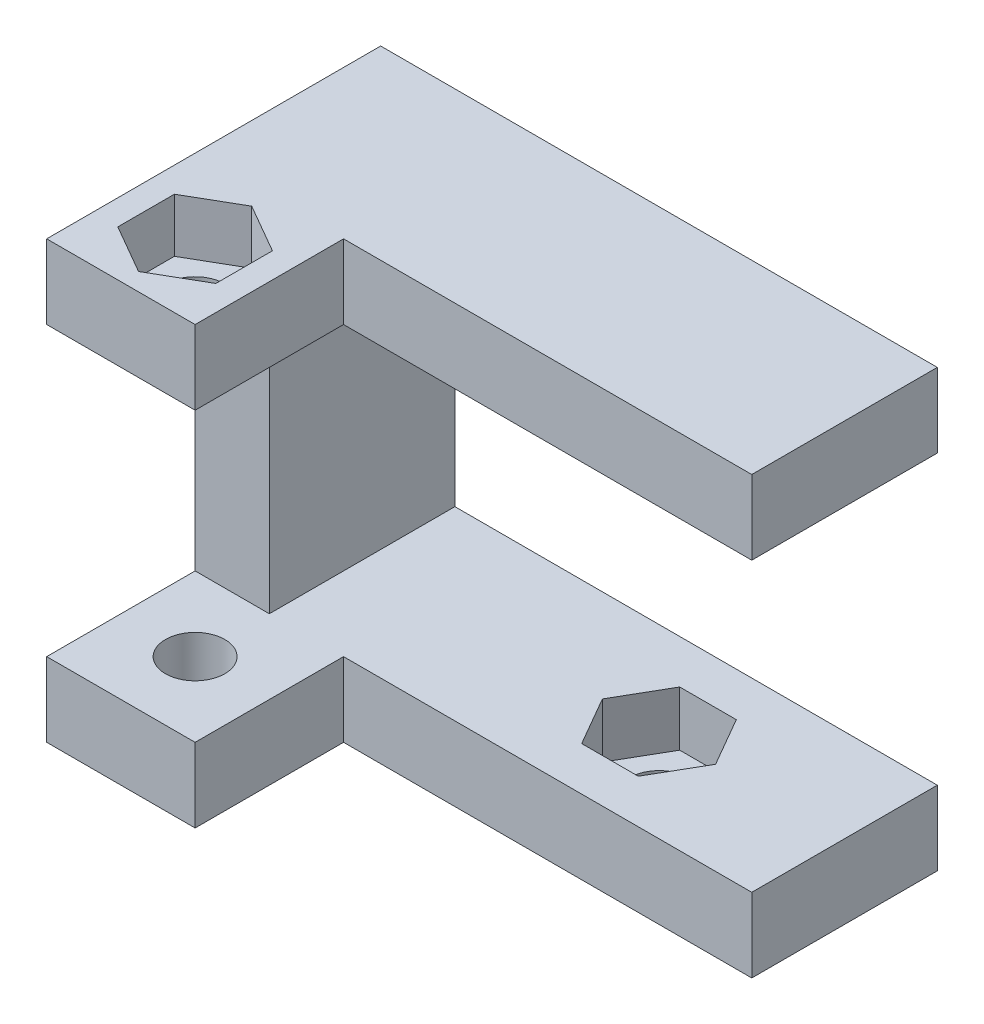
ISO-10303-21;
HEADER;
FILE_DESCRIPTION(('STEP AP214'),'2;1');
FILE_NAME('part.step','',(''),(''),'','','');
FILE_SCHEMA(('AUTOMOTIVE_DESIGN { 1 0 10303 214 1 1 1 1 }'));
ENDSEC;
DATA;
#1=APPLICATION_CONTEXT('core data for automotive mechanical design processes');
#2=APPLICATION_PROTOCOL_DEFINITION('international standard','automotive_design',2000,#1);
#3=PRODUCT_CONTEXT('',#1,'mechanical');
#4=PRODUCT('Part','Part','',(#3));
#5=PRODUCT_RELATED_PRODUCT_CATEGORY('part','',(#4));
#6=PRODUCT_DEFINITION_FORMATION('','',#4);
#7=PRODUCT_DEFINITION_CONTEXT('part definition',#1,'design');
#8=PRODUCT_DEFINITION('design','',#6,#7);
#9=PRODUCT_DEFINITION_SHAPE('','',#8);
#10=(LENGTH_UNIT() NAMED_UNIT(*) SI_UNIT(.MILLI.,.METRE.));
#11=(NAMED_UNIT(*) PLANE_ANGLE_UNIT() SI_UNIT($,.RADIAN.));
#12=(NAMED_UNIT(*) SI_UNIT($,.STERADIAN.) SOLID_ANGLE_UNIT());
#13=UNCERTAINTY_MEASURE_WITH_UNIT(LENGTH_MEASURE(1.E-05),#10,'distance_accuracy_value','');
#14=(GEOMETRIC_REPRESENTATION_CONTEXT(3) GLOBAL_UNCERTAINTY_ASSIGNED_CONTEXT((#13)) GLOBAL_UNIT_ASSIGNED_CONTEXT((#10,
#11,#12)) REPRESENTATION_CONTEXT('',''));
#15=CARTESIAN_POINT('',(0.,0.,0.));
#16=DIRECTION('',(0.,0.,1.));
#17=DIRECTION('',(1.,0.,0.));
#18=AXIS2_PLACEMENT_3D('',#15,#16,#17);
#19=CARTESIAN_POINT('',(0.,0.,10.));
#20=DIRECTION('',(0.,0.,1.));
#21=DIRECTION('',(1.,0.,0.));
#22=AXIS2_PLACEMENT_3D('',#19,#20,#21);
#23=PLANE('',#22);
#24=DIRECTION('',(-1.,0.,0.));
#25=VECTOR('',#24,1.);
#26=CARTESIAN_POINT('',(0.,-19.5,10.));
#27=LINE('',#26,#25);
#28=CARTESIAN_POINT('',(0.,-19.5,10.));
#29=VERTEX_POINT('',#28);
#30=CARTESIAN_POINT('',(-22.,-19.5,10.));
#31=VERTEX_POINT('',#30);
#32=EDGE_CURVE('E57',#29,#31,#27,.T.);
#33=ORIENTED_EDGE('',*,*,#32,.T.);
#34=DIRECTION('',(0.,1.,0.));
#35=VECTOR('',#34,1.);
#36=CARTESIAN_POINT('',(-22.,-23.5,10.));
#37=LINE('',#36,#35);
#38=CARTESIAN_POINT('',(-22.,-23.5,10.));
#39=VERTEX_POINT('',#38);
#40=EDGE_CURVE('E257',#39,#31,#37,.T.);
#41=ORIENTED_EDGE('',*,*,#40,.F.);
#42=DIRECTION('',(1.,0.,0.));
#43=VECTOR('',#42,1.);
#44=CARTESIAN_POINT('',(-30.,-23.5,10.));
#45=LINE('',#44,#43);
#46=CARTESIAN_POINT('',(0.,-23.5,10.));
#47=VERTEX_POINT('',#46);
#48=EDGE_CURVE('E372',#39,#47,#45,.T.);
#49=ORIENTED_EDGE('',*,*,#48,.T.);
#50=DIRECTION('',(0.,1.,0.));
#51=VECTOR('',#50,1.);
#52=CARTESIAN_POINT('',(0.,-23.5,10.));
#53=LINE('',#52,#51);
#54=EDGE_CURVE('E484',#47,#29,#53,.T.);
#55=ORIENTED_EDGE('',*,*,#54,.T.);
#56=EDGE_LOOP('',(#33,#41,#49,#55));
#57=FACE_BOUND('',#56,.T.);
#58=ADVANCED_FACE('F33',(#57),#23,.T.);
#59=DIRECTION('',(0.,-1.,0.));
#60=VECTOR('',#59,1.);
#61=CARTESIAN_POINT('',(-30.,0.,10.));
#62=LINE('',#61,#60);
#63=CARTESIAN_POINT('',(-30.,-4.,10.));
#64=VERTEX_POINT('',#63);
#65=CARTESIAN_POINT('',(-30.,-19.5,10.));
#66=VERTEX_POINT('',#65);
#67=EDGE_CURVE('E369',#64,#66,#62,.T.);
#68=ORIENTED_EDGE('',*,*,#67,.T.);
#69=DIRECTION('',(1.,0.,0.));
#70=VECTOR('',#69,1.);
#71=CARTESIAN_POINT('',(0.,-19.5,10.));
#72=LINE('',#71,#70);
#73=CARTESIAN_POINT('',(-26.,-19.5,10.));
#74=VERTEX_POINT('',#73);
#75=EDGE_CURVE('E11',#66,#74,#72,.T.);
#76=ORIENTED_EDGE('',*,*,#75,.T.);
#77=DIRECTION('',(0.,1.,0.));
#78=VECTOR('',#77,1.);
#79=CARTESIAN_POINT('',(-26.,-19.5,10.));
#80=LINE('',#79,#78);
#81=CARTESIAN_POINT('',(-26.,-4.,10.));
#82=VERTEX_POINT('',#81);
#83=EDGE_CURVE('E377',#74,#82,#80,.T.);
#84=ORIENTED_EDGE('',*,*,#83,.T.);
#85=DIRECTION('',(1.,0.,0.));
#86=VECTOR('',#85,1.);
#87=CARTESIAN_POINT('',(-30.,-4.,10.));
#88=LINE('',#87,#86);
#89=EDGE_CURVE('E284',#64,#82,#88,.T.);
#90=ORIENTED_EDGE('',*,*,#89,.F.);
#91=EDGE_LOOP('',(#68,#76,#84,#90));
#92=FACE_BOUND('',#91,.T.);
#93=ADVANCED_FACE('F455',(#92),#23,.T.);
#94=DIRECTION('',(0.,1.,0.));
#95=VECTOR('',#94,1.);
#96=CARTESIAN_POINT('',(-22.,0.,10.));
#97=LINE('',#96,#95);
#98=CARTESIAN_POINT('',(-22.,-4.,10.));
#99=VERTEX_POINT('',#98);
#100=CARTESIAN_POINT('',(-22.,0.,10.));
#101=VERTEX_POINT('',#100);
#102=EDGE_CURVE('E289',#99,#101,#97,.T.);
#103=ORIENTED_EDGE('',*,*,#102,.F.);
#104=DIRECTION('',(1.,0.,0.));
#105=VECTOR('',#104,1.);
#106=CARTESIAN_POINT('',(-26.,-4.,10.));
#107=LINE('',#106,#105);
#108=CARTESIAN_POINT('',(0.,-4.,10.));
#109=VERTEX_POINT('',#108);
#110=EDGE_CURVE('E373',#99,#109,#107,.T.);
#111=ORIENTED_EDGE('',*,*,#110,.T.);
#112=DIRECTION('',(0.,1.,0.));
#113=VECTOR('',#112,1.);
#114=CARTESIAN_POINT('',(0.,-4.,10.));
#115=LINE('',#114,#113);
#116=CARTESIAN_POINT('',(0.,0.,10.));
#117=VERTEX_POINT('',#116);
#118=EDGE_CURVE('E357',#109,#117,#115,.T.);
#119=ORIENTED_EDGE('',*,*,#118,.T.);
#120=DIRECTION('',(-1.,0.,0.));
#121=VECTOR('',#120,1.);
#122=CARTESIAN_POINT('',(0.,0.,10.));
#123=LINE('',#122,#121);
#124=EDGE_CURVE('E360',#117,#101,#123,.T.);
#125=ORIENTED_EDGE('',*,*,#124,.T.);
#126=EDGE_LOOP('',(#103,#111,#119,#125));
#127=FACE_BOUND('',#126,.T.);
#128=ADVANCED_FACE('F505',(#127),#23,.T.);
#129=CARTESIAN_POINT('',(-10.,-23.501,5.));
#130=DIRECTION('',(0.,1.,0.));
#131=DIRECTION('',(-1.,0.,0.));
#132=AXIS2_PLACEMENT_3D('',#129,#130,#131);
#133=CYLINDRICAL_SURFACE('',#132,1.6);
#134=CARTESIAN_POINT('',(-10.,-23.5,5.));
#135=DIRECTION('',(0.,1.,0.));
#136=DIRECTION('',(0.,0.,1.));
#137=AXIS2_PLACEMENT_3D('',#134,#135,#136);
#138=CIRCLE('',#137,1.6);
#139=CARTESIAN_POINT('',(-10.,-23.5,6.6));
#140=VERTEX_POINT('',#139);
#141=EDGE_CURVE('E353',#140,#140,#138,.F.);
#142=ORIENTED_EDGE('',*,*,#141,.T.);
#143=EDGE_LOOP('',(#142));
#144=FACE_BOUND('',#143,.T.);
#145=CARTESIAN_POINT('',(-10.,-22.45,5.));
#146=DIRECTION('',(0.,1.,0.));
#147=DIRECTION('',(0.,0.,1.));
#148=AXIS2_PLACEMENT_3D('',#145,#146,#147);
#149=CIRCLE('',#148,1.6);
#150=CARTESIAN_POINT('',(-10.,-22.45,6.6));
#151=VERTEX_POINT('',#150);
#152=EDGE_CURVE('E342',#151,#151,#149,.F.);
#153=ORIENTED_EDGE('',*,*,#152,.F.);
#154=EDGE_LOOP('',(#153));
#155=FACE_BOUND('',#154,.T.);
#156=ADVANCED_FACE('F512',(#144,#155),#133,.F.);
#157=CARTESIAN_POINT('',(0.,-4.,10.));
#158=DIRECTION('',(-1.,0.,0.));
#159=DIRECTION('',(0.,0.,1.));
#160=AXIS2_PLACEMENT_3D('',#157,#158,#159);
#161=PLANE('',#160);
#162=DIRECTION('',(0.,1.,0.));
#163=VECTOR('',#162,1.);
#164=CARTESIAN_POINT('',(0.,-4.,0.));
#165=LINE('',#164,#163);
#166=CARTESIAN_POINT('',(0.,-4.,0.));
#167=VERTEX_POINT('',#166);
#168=CARTESIAN_POINT('',(0.,0.,0.));
#169=VERTEX_POINT('',#168);
#170=EDGE_CURVE('E356',#167,#169,#165,.T.);
#171=ORIENTED_EDGE('',*,*,#170,.T.);
#172=DIRECTION('',(0.,0.,-1.));
#173=VECTOR('',#172,1.);
#174=CARTESIAN_POINT('',(0.,0.,10.));
#175=LINE('',#174,#173);
#176=EDGE_CURVE('E42',#117,#169,#175,.T.);
#177=ORIENTED_EDGE('',*,*,#176,.F.);
#178=ORIENTED_EDGE('',*,*,#118,.F.);
#179=DIRECTION('',(0.,0.,-1.));
#180=VECTOR('',#179,1.);
#181=CARTESIAN_POINT('',(0.,-4.,10.));
#182=LINE('',#181,#180);
#183=EDGE_CURVE('E376',#109,#167,#182,.T.);
#184=ORIENTED_EDGE('',*,*,#183,.T.);
#185=EDGE_LOOP('',(#171,#177,#178,#184));
#186=FACE_BOUND('',#185,.T.);
#187=ADVANCED_FACE('F35',(#186),#161,.F.);
#188=CARTESIAN_POINT('',(0.,0.,10.));
#189=DIRECTION('',(0.,-1.,0.));
#190=DIRECTION('',(1.,0.,0.));
#191=AXIS2_PLACEMENT_3D('',#188,#189,#190);
#192=PLANE('',#191);
#193=DIRECTION('',(0.866025403784439,0.,-0.499999999999999));
#194=VECTOR('',#193,1.);
#195=CARTESIAN_POINT('',(-26.,0.,17.05));
#196=LINE('',#195,#194);
#197=CARTESIAN_POINT('',(-26.,0.,17.05));
#198=VERTEX_POINT('',#197);
#199=CARTESIAN_POINT('',(-23.3586225184575,0.,15.525));
#200=VERTEX_POINT('',#199);
#201=EDGE_CURVE('E245',#198,#200,#196,.T.);
#202=ORIENTED_EDGE('',*,*,#201,.F.);
#203=DIRECTION('',(0.866025403784439,0.,0.499999999999999));
#204=VECTOR('',#203,1.);
#205=CARTESIAN_POINT('',(-28.6413774815425,0.,15.525));
#206=LINE('',#205,#204);
#207=CARTESIAN_POINT('',(-28.6413774815425,0.,15.525));
#208=VERTEX_POINT('',#207);
#209=EDGE_CURVE('E49',#208,#198,#206,.T.);
#210=ORIENTED_EDGE('',*,*,#209,.F.);
#211=DIRECTION('',(0.,0.,1.));
#212=VECTOR('',#211,1.);
#213=CARTESIAN_POINT('',(-28.6413774815425,0.,12.475));
#214=LINE('',#213,#212);
#215=CARTESIAN_POINT('',(-28.6413774815425,0.,12.475));
#216=VERTEX_POINT('',#215);
#217=EDGE_CURVE('E228',#216,#208,#214,.T.);
#218=ORIENTED_EDGE('',*,*,#217,.F.);
#219=DIRECTION('',(-0.866025403784439,0.,0.5));
#220=VECTOR('',#219,1.);
#221=CARTESIAN_POINT('',(-26.,0.,10.95));
#222=LINE('',#221,#220);
#223=CARTESIAN_POINT('',(-26.,0.,10.95));
#224=VERTEX_POINT('',#223);
#225=EDGE_CURVE('E231',#224,#216,#222,.T.);
#226=ORIENTED_EDGE('',*,*,#225,.F.);
#227=DIRECTION('',(-0.866025403784439,0.,-0.5));
#228=VECTOR('',#227,1.);
#229=CARTESIAN_POINT('',(-23.3586225184575,0.,12.475));
#230=LINE('',#229,#228);
#231=CARTESIAN_POINT('',(-23.3586225184575,0.,12.475));
#232=VERTEX_POINT('',#231);
#233=EDGE_CURVE('E250',#232,#224,#230,.T.);
#234=ORIENTED_EDGE('',*,*,#233,.F.);
#235=DIRECTION('',(0.,0.,-1.));
#236=VECTOR('',#235,1.);
#237=CARTESIAN_POINT('',(-23.3586225184575,0.,15.525));
#238=LINE('',#237,#236);
#239=EDGE_CURVE('E247',#200,#232,#238,.T.);
#240=ORIENTED_EDGE('',*,*,#239,.F.);
#241=EDGE_LOOP('',(#202,#210,#218,#226,#234,#240));
#242=FACE_BOUND('',#241,.T.);
#243=DIRECTION('',(-1.,0.,0.));
#244=VECTOR('',#243,1.);
#245=CARTESIAN_POINT('',(0.,0.,0.));
#246=LINE('',#245,#244);
#247=CARTESIAN_POINT('',(-30.,0.,0.));
#248=VERTEX_POINT('',#247);
#249=EDGE_CURVE('E386',#169,#248,#246,.T.);
#250=ORIENTED_EDGE('',*,*,#249,.T.);
#251=DIRECTION('',(0.,0.,-1.));
#252=VECTOR('',#251,1.);
#253=CARTESIAN_POINT('',(-30.,0.,10.));
#254=LINE('',#253,#252);
#255=CARTESIAN_POINT('',(-30.,0.,18.));
#256=VERTEX_POINT('',#255);
#257=EDGE_CURVE('E414',#256,#248,#254,.T.);
#258=ORIENTED_EDGE('',*,*,#257,.F.);
#259=DIRECTION('',(-1.,0.,0.));
#260=VECTOR('',#259,1.);
#261=CARTESIAN_POINT('',(-30.,0.,18.));
#262=LINE('',#261,#260);
#263=CARTESIAN_POINT('',(-22.,0.,18.));
#264=VERTEX_POINT('',#263);
#265=EDGE_CURVE('E293',#264,#256,#262,.T.);
#266=ORIENTED_EDGE('',*,*,#265,.F.);
#267=DIRECTION('',(0.,0.,-1.));
#268=VECTOR('',#267,1.);
#269=CARTESIAN_POINT('',(-22.,0.,18.));
#270=LINE('',#269,#268);
#271=EDGE_CURVE('E296',#264,#101,#270,.T.);
#272=ORIENTED_EDGE('',*,*,#271,.T.);
#273=ORIENTED_EDGE('',*,*,#124,.F.);
#274=ORIENTED_EDGE('',*,*,#176,.T.);
#275=EDGE_LOOP('',(#250,#258,#266,#272,#273,#274));
#276=FACE_BOUND('',#275,.T.);
#277=ADVANCED_FACE('F419',(#242,#276),#192,.F.);
#278=CARTESIAN_POINT('',(-30.,0.,10.));
#279=DIRECTION('',(1.,0.,0.));
#280=DIRECTION('',(0.,1.,0.));
#281=AXIS2_PLACEMENT_3D('',#278,#279,#280);
#282=PLANE('',#281);
#283=DIRECTION('',(0.,-1.,0.));
#284=VECTOR('',#283,1.);
#285=CARTESIAN_POINT('',(-30.,0.,0.));
#286=LINE('',#285,#284);
#287=CARTESIAN_POINT('',(-30.,-23.5,0.));
#288=VERTEX_POINT('',#287);
#289=EDGE_CURVE('E388',#248,#288,#286,.T.);
#290=ORIENTED_EDGE('',*,*,#289,.T.);
#291=DIRECTION('',(0.,0.,-1.));
#292=VECTOR('',#291,1.);
#293=CARTESIAN_POINT('',(-30.,-23.5,10.));
#294=LINE('',#293,#292);
#295=CARTESIAN_POINT('',(-30.,-23.5,18.));
#296=VERTEX_POINT('',#295);
#297=EDGE_CURVE('E411',#296,#288,#294,.T.);
#298=ORIENTED_EDGE('',*,*,#297,.F.);
#299=DIRECTION('',(0.,-1.,0.));
#300=VECTOR('',#299,1.);
#301=CARTESIAN_POINT('',(-30.,-23.5,18.));
#302=LINE('',#301,#300);
#303=CARTESIAN_POINT('',(-30.,-19.5,18.));
#304=VERTEX_POINT('',#303);
#305=EDGE_CURVE('E265',#304,#296,#302,.T.);
#306=ORIENTED_EDGE('',*,*,#305,.F.);
#307=DIRECTION('',(0.,0.,-1.));
#308=VECTOR('',#307,1.);
#309=CARTESIAN_POINT('',(-30.,-19.5,18.));
#310=LINE('',#309,#308);
#311=EDGE_CURVE('E274',#304,#66,#310,.T.);
#312=ORIENTED_EDGE('',*,*,#311,.T.);
#313=ORIENTED_EDGE('',*,*,#67,.F.);
#314=DIRECTION('',(0.,0.,-1.));
#315=VECTOR('',#314,1.);
#316=CARTESIAN_POINT('',(-30.,-4.,18.));
#317=LINE('',#316,#315);
#318=CARTESIAN_POINT('',(-30.,-4.,18.));
#319=VERTEX_POINT('',#318);
#320=EDGE_CURVE('E326',#319,#64,#317,.T.);
#321=ORIENTED_EDGE('',*,*,#320,.F.);
#322=DIRECTION('',(0.,-1.,0.));
#323=VECTOR('',#322,1.);
#324=CARTESIAN_POINT('',(-30.,0.,18.));
#325=LINE('',#324,#323);
#326=EDGE_CURVE('E285',#256,#319,#325,.T.);
#327=ORIENTED_EDGE('',*,*,#326,.F.);
#328=ORIENTED_EDGE('',*,*,#257,.T.);
#329=EDGE_LOOP('',(#290,#298,#306,#312,#313,#321,#327,#328));
#330=FACE_BOUND('',#329,.T.);
#331=ADVANCED_FACE('F433',(#330),#282,.F.);
#332=CARTESIAN_POINT('',(-30.,-23.5,10.));
#333=DIRECTION('',(0.,1.,0.));
#334=DIRECTION('',(0.,0.,1.));
#335=AXIS2_PLACEMENT_3D('',#332,#333,#334);
#336=PLANE('',#335);
#337=CARTESIAN_POINT('',(-26.,-23.5,14.));
#338=DIRECTION('',(0.,1.,0.));
#339=DIRECTION('',(-1.,0.,0.));
#340=AXIS2_PLACEMENT_3D('',#337,#338,#339);
#341=CIRCLE('',#340,1.6);
#342=CARTESIAN_POINT('',(-27.6,-23.5,14.));
#343=VERTEX_POINT('',#342);
#344=EDGE_CURVE('E708',#343,#343,#341,.T.);
#345=ORIENTED_EDGE('',*,*,#344,.T.);
#346=EDGE_LOOP('',(#345));
#347=FACE_BOUND('',#346,.T.);
#348=ORIENTED_EDGE('',*,*,#141,.F.);
#349=EDGE_LOOP('',(#348));
#350=FACE_BOUND('',#349,.T.);
#351=DIRECTION('',(1.,0.,0.));
#352=VECTOR('',#351,1.);
#353=CARTESIAN_POINT('',(-30.,-23.5,0.));
#354=LINE('',#353,#352);
#355=CARTESIAN_POINT('',(0.,-23.5,0.));
#356=VERTEX_POINT('',#355);
#357=EDGE_CURVE('E390',#288,#356,#354,.T.);
#358=ORIENTED_EDGE('',*,*,#357,.T.);
#359=DIRECTION('',(0.,0.,-1.));
#360=VECTOR('',#359,1.);
#361=CARTESIAN_POINT('',(0.,-23.5,10.));
#362=LINE('',#361,#360);
#363=EDGE_CURVE('E408',#47,#356,#362,.T.);
#364=ORIENTED_EDGE('',*,*,#363,.F.);
#365=ORIENTED_EDGE('',*,*,#48,.F.);
#366=DIRECTION('',(0.,0.,-1.));
#367=VECTOR('',#366,1.);
#368=CARTESIAN_POINT('',(-22.,-23.5,18.));
#369=LINE('',#368,#367);
#370=CARTESIAN_POINT('',(-22.,-23.5,18.));
#371=VERTEX_POINT('',#370);
#372=EDGE_CURVE('E281',#371,#39,#369,.T.);
#373=ORIENTED_EDGE('',*,*,#372,.F.);
#374=DIRECTION('',(1.,0.,0.));
#375=VECTOR('',#374,1.);
#376=CARTESIAN_POINT('',(-30.,-23.5,18.));
#377=LINE('',#376,#375);
#378=EDGE_CURVE('E268',#296,#371,#377,.T.);
#379=ORIENTED_EDGE('',*,*,#378,.F.);
#380=ORIENTED_EDGE('',*,*,#297,.T.);
#381=EDGE_LOOP('',(#358,#364,#365,#373,#379,#380));
#382=FACE_BOUND('',#381,.T.);
#383=ADVANCED_FACE('F438',(#347,#350,#382),#336,.F.);
#384=CARTESIAN_POINT('',(0.,-23.5,10.));
#385=DIRECTION('',(-1.,0.,0.));
#386=DIRECTION('',(0.,0.,1.));
#387=AXIS2_PLACEMENT_3D('',#384,#385,#386);
#388=PLANE('',#387);
#389=DIRECTION('',(0.,1.,0.));
#390=VECTOR('',#389,1.);
#391=CARTESIAN_POINT('',(0.,-23.5,0.));
#392=LINE('',#391,#390);
#393=CARTESIAN_POINT('',(0.,-19.5,0.));
#394=VERTEX_POINT('',#393);
#395=EDGE_CURVE('E392',#356,#394,#392,.T.);
#396=ORIENTED_EDGE('',*,*,#395,.T.);
#397=DIRECTION('',(0.,0.,-1.));
#398=VECTOR('',#397,1.);
#399=CARTESIAN_POINT('',(0.,-19.5,10.));
#400=LINE('',#399,#398);
#401=EDGE_CURVE('E405',#29,#394,#400,.T.);
#402=ORIENTED_EDGE('',*,*,#401,.F.);
#403=ORIENTED_EDGE('',*,*,#54,.F.);
#404=ORIENTED_EDGE('',*,*,#363,.T.);
#405=EDGE_LOOP('',(#396,#402,#403,#404));
#406=FACE_BOUND('',#405,.T.);
#407=ADVANCED_FACE('F488',(#406),#388,.F.);
#408=CARTESIAN_POINT('',(0.,-19.5,10.));
#409=DIRECTION('',(0.,-1.,0.));
#410=DIRECTION('',(1.,0.,0.));
#411=AXIS2_PLACEMENT_3D('',#408,#409,#410);
#412=PLANE('',#411);
#413=CARTESIAN_POINT('',(-26.,-19.5,14.));
#414=DIRECTION('',(0.,-1.,0.));
#415=DIRECTION('',(1.,0.,0.));
#416=AXIS2_PLACEMENT_3D('',#413,#414,#415);
#417=CIRCLE('',#416,1.6);
#418=CARTESIAN_POINT('',(-24.4,-19.5,14.));
#419=VERTEX_POINT('',#418);
#420=EDGE_CURVE('E234',#419,#419,#417,.T.);
#421=ORIENTED_EDGE('',*,*,#420,.T.);
#422=EDGE_LOOP('',(#421));
#423=FACE_BOUND('',#422,.T.);
#424=DIRECTION('',(0.499999999999999,0.,-0.866025403784439));
#425=VECTOR('',#424,1.);
#426=CARTESIAN_POINT('',(-8.47499999999999,-19.5,7.64137748154254));
#427=LINE('',#426,#425);
#428=CARTESIAN_POINT('',(-8.47499999999999,-19.5,7.64137748154254));
#429=VERTEX_POINT('',#428);
#430=CARTESIAN_POINT('',(-6.95,-19.5,5.));
#431=VERTEX_POINT('',#430);
#432=EDGE_CURVE('E325',#429,#431,#427,.T.);
#433=ORIENTED_EDGE('',*,*,#432,.F.);
#434=DIRECTION('',(1.,0.,0.));
#435=VECTOR('',#434,1.);
#436=CARTESIAN_POINT('',(-11.525,-19.5,7.64137748154254));
#437=LINE('',#436,#435);
#438=CARTESIAN_POINT('',(-11.525,-19.5,7.64137748154254));
#439=VERTEX_POINT('',#438);
#440=EDGE_CURVE('E323',#439,#429,#437,.T.);
#441=ORIENTED_EDGE('',*,*,#440,.F.);
#442=DIRECTION('',(0.5,0.,0.866025403784439));
#443=VECTOR('',#442,1.);
#444=CARTESIAN_POINT('',(-13.05,-19.5,5.));
#445=LINE('',#444,#443);
#446=CARTESIAN_POINT('',(-13.05,-19.5,5.));
#447=VERTEX_POINT('',#446);
#448=EDGE_CURVE('E307',#447,#439,#445,.T.);
#449=ORIENTED_EDGE('',*,*,#448,.F.);
#450=DIRECTION('',(-0.5,0.,0.866025403784439));
#451=VECTOR('',#450,1.);
#452=CARTESIAN_POINT('',(-11.525,-19.5,2.35862251845746));
#453=LINE('',#452,#451);
#454=CARTESIAN_POINT('',(-11.525,-19.5,2.35862251845746));
#455=VERTEX_POINT('',#454);
#456=EDGE_CURVE('E335',#455,#447,#453,.T.);
#457=ORIENTED_EDGE('',*,*,#456,.F.);
#458=DIRECTION('',(-1.,0.,0.));
#459=VECTOR('',#458,1.);
#460=CARTESIAN_POINT('',(-8.475,-19.5,2.35862251845746));
#461=LINE('',#460,#459);
#462=CARTESIAN_POINT('',(-8.475,-19.5,2.35862251845746));
#463=VERTEX_POINT('',#462);
#464=EDGE_CURVE('E332',#463,#455,#461,.T.);
#465=ORIENTED_EDGE('',*,*,#464,.F.);
#466=DIRECTION('',(-0.5,0.,-0.866025403784439));
#467=VECTOR('',#466,1.);
#468=CARTESIAN_POINT('',(-6.95,-19.5,5.));
#469=LINE('',#468,#467);
#470=EDGE_CURVE('E329',#431,#463,#469,.T.);
#471=ORIENTED_EDGE('',*,*,#470,.F.);
#472=EDGE_LOOP('',(#433,#441,#449,#457,#465,#471));
#473=FACE_BOUND('',#472,.T.);
#474=DIRECTION('',(-1.,0.,0.));
#475=VECTOR('',#474,1.);
#476=CARTESIAN_POINT('',(0.,-19.5,0.));
#477=LINE('',#476,#475);
#478=CARTESIAN_POINT('',(-26.,-19.5,0.));
#479=VERTEX_POINT('',#478);
#480=EDGE_CURVE('E394',#394,#479,#477,.T.);
#481=ORIENTED_EDGE('',*,*,#480,.T.);
#482=DIRECTION('',(0.,0.,-1.));
#483=VECTOR('',#482,1.);
#484=CARTESIAN_POINT('',(-26.,-19.5,10.));
#485=LINE('',#484,#483);
#486=EDGE_CURVE('E402',#74,#479,#485,.T.);
#487=ORIENTED_EDGE('',*,*,#486,.F.);
#488=ORIENTED_EDGE('',*,*,#75,.F.);
#489=ORIENTED_EDGE('',*,*,#311,.F.);
#490=DIRECTION('',(-1.,0.,0.));
#491=VECTOR('',#490,1.);
#492=CARTESIAN_POINT('',(-30.,-19.5,18.));
#493=LINE('',#492,#491);
#494=CARTESIAN_POINT('',(-22.,-19.5,18.));
#495=VERTEX_POINT('',#494);
#496=EDGE_CURVE('E272',#495,#304,#493,.T.);
#497=ORIENTED_EDGE('',*,*,#496,.F.);
#498=DIRECTION('',(0.,0.,-1.));
#499=VECTOR('',#498,1.);
#500=CARTESIAN_POINT('',(-22.,-19.5,18.));
#501=LINE('',#500,#499);
#502=EDGE_CURVE('E278',#495,#31,#501,.T.);
#503=ORIENTED_EDGE('',*,*,#502,.T.);
#504=ORIENTED_EDGE('',*,*,#32,.F.);
#505=ORIENTED_EDGE('',*,*,#401,.T.);
#506=EDGE_LOOP('',(#481,#487,#488,#489,#497,#503,#504,#505));
#507=FACE_BOUND('',#506,.T.);
#508=ADVANCED_FACE('F452',(#423,#473,#507),#412,.F.);
#509=CARTESIAN_POINT('',(-26.,-19.5,10.));
#510=DIRECTION('',(-1.,0.,0.));
#511=DIRECTION('',(0.,0.,1.));
#512=AXIS2_PLACEMENT_3D('',#509,#510,#511);
#513=PLANE('',#512);
#514=DIRECTION('',(0.,1.,0.));
#515=VECTOR('',#514,1.);
#516=CARTESIAN_POINT('',(-26.,-19.5,0.));
#517=LINE('',#516,#515);
#518=CARTESIAN_POINT('',(-26.,-4.,0.));
#519=VERTEX_POINT('',#518);
#520=EDGE_CURVE('E396',#479,#519,#517,.T.);
#521=ORIENTED_EDGE('',*,*,#520,.T.);
#522=DIRECTION('',(0.,0.,-1.));
#523=VECTOR('',#522,1.);
#524=CARTESIAN_POINT('',(-26.,-4.,10.));
#525=LINE('',#524,#523);
#526=EDGE_CURVE('E401',#82,#519,#525,.T.);
#527=ORIENTED_EDGE('',*,*,#526,.F.);
#528=ORIENTED_EDGE('',*,*,#83,.F.);
#529=ORIENTED_EDGE('',*,*,#486,.T.);
#530=EDGE_LOOP('',(#521,#527,#528,#529));
#531=FACE_BOUND('',#530,.T.);
#532=ADVANCED_FACE('F661',(#531),#513,.F.);
#533=CARTESIAN_POINT('',(-26.,-4.,10.));
#534=DIRECTION('',(0.,1.,0.));
#535=DIRECTION('',(0.,0.,1.));
#536=AXIS2_PLACEMENT_3D('',#533,#534,#535);
#537=PLANE('',#536);
#538=CARTESIAN_POINT('',(-26.,-4.,14.));
#539=DIRECTION('',(0.,1.,0.));
#540=DIRECTION('',(0.,0.,1.));
#541=AXIS2_PLACEMENT_3D('',#538,#539,#540);
#542=CIRCLE('',#541,1.6);
#543=CARTESIAN_POINT('',(-26.,-4.,15.6));
#544=VERTEX_POINT('',#543);
#545=EDGE_CURVE('E711',#544,#544,#542,.T.);
#546=ORIENTED_EDGE('',*,*,#545,.T.);
#547=EDGE_LOOP('',(#546));
#548=FACE_BOUND('',#547,.T.);
#549=DIRECTION('',(1.,0.,0.));
#550=VECTOR('',#549,1.);
#551=CARTESIAN_POINT('',(-26.,-4.,0.));
#552=LINE('',#551,#550);
#553=EDGE_CURVE('E361',#519,#167,#552,.T.);
#554=ORIENTED_EDGE('',*,*,#553,.T.);
#555=ORIENTED_EDGE('',*,*,#183,.F.);
#556=ORIENTED_EDGE('',*,*,#110,.F.);
#557=DIRECTION('',(0.,0.,-1.));
#558=VECTOR('',#557,1.);
#559=CARTESIAN_POINT('',(-22.,-4.,18.));
#560=LINE('',#559,#558);
#561=CARTESIAN_POINT('',(-22.,-4.,18.));
#562=VERTEX_POINT('',#561);
#563=EDGE_CURVE('E378',#562,#99,#560,.T.);
#564=ORIENTED_EDGE('',*,*,#563,.F.);
#565=DIRECTION('',(1.,0.,0.));
#566=VECTOR('',#565,1.);
#567=CARTESIAN_POINT('',(-30.,-4.,18.));
#568=LINE('',#567,#566);
#569=EDGE_CURVE('E288',#319,#562,#568,.T.);
#570=ORIENTED_EDGE('',*,*,#569,.F.);
#571=ORIENTED_EDGE('',*,*,#320,.T.);
#572=ORIENTED_EDGE('',*,*,#89,.T.);
#573=ORIENTED_EDGE('',*,*,#526,.T.);
#574=EDGE_LOOP('',(#554,#555,#556,#564,#570,#571,#572,#573));
#575=FACE_BOUND('',#574,.T.);
#576=ADVANCED_FACE('F459',(#548,#575),#537,.F.);
#577=CARTESIAN_POINT('',(0.,0.,0.));
#578=DIRECTION('',(0.,0.,1.));
#579=DIRECTION('',(1.,0.,0.));
#580=AXIS2_PLACEMENT_3D('',#577,#578,#579);
#581=PLANE('',#580);
#582=ORIENTED_EDGE('',*,*,#170,.F.);
#583=ORIENTED_EDGE('',*,*,#553,.F.);
#584=ORIENTED_EDGE('',*,*,#520,.F.);
#585=ORIENTED_EDGE('',*,*,#480,.F.);
#586=ORIENTED_EDGE('',*,*,#395,.F.);
#587=ORIENTED_EDGE('',*,*,#357,.F.);
#588=ORIENTED_EDGE('',*,*,#289,.F.);
#589=ORIENTED_EDGE('',*,*,#249,.F.);
#590=EDGE_LOOP('',(#582,#583,#584,#585,#586,#587,#588,#589));
#591=FACE_BOUND('',#590,.T.);
#592=ADVANCED_FACE('F427',(#591),#581,.F.);
#593=CARTESIAN_POINT('',(0.,-22.45,0.));
#594=DIRECTION('',(0.,1.,0.));
#595=DIRECTION('',(0.,0.,1.));
#596=AXIS2_PLACEMENT_3D('',#593,#594,#595);
#597=PLANE('',#596);
#598=DIRECTION('',(1.,0.,0.));
#599=VECTOR('',#598,1.);
#600=CARTESIAN_POINT('',(-11.525,-22.45,7.64137748154254));
#601=LINE('',#600,#599);
#602=CARTESIAN_POINT('',(-11.525,-22.45,7.64137748154254));
#603=VERTEX_POINT('',#602);
#604=CARTESIAN_POINT('',(-8.47499999999999,-22.45,7.64137748154254));
#605=VERTEX_POINT('',#604);
#606=EDGE_CURVE('E303',#603,#605,#601,.T.);
#607=ORIENTED_EDGE('',*,*,#606,.T.);
#608=DIRECTION('',(0.499999999999999,0.,-0.866025403784439));
#609=VECTOR('',#608,1.);
#610=CARTESIAN_POINT('',(-8.47499999999999,-22.45,7.64137748154254));
#611=LINE('',#610,#609);
#612=CARTESIAN_POINT('',(-6.95,-22.45,5.));
#613=VERTEX_POINT('',#612);
#614=EDGE_CURVE('E306',#605,#613,#611,.T.);
#615=ORIENTED_EDGE('',*,*,#614,.T.);
#616=DIRECTION('',(-0.5,0.,-0.866025403784439));
#617=VECTOR('',#616,1.);
#618=CARTESIAN_POINT('',(-6.95,-22.45,5.));
#619=LINE('',#618,#617);
#620=CARTESIAN_POINT('',(-8.475,-22.45,2.35862251845746));
#621=VERTEX_POINT('',#620);
#622=EDGE_CURVE('E310',#613,#621,#619,.T.);
#623=ORIENTED_EDGE('',*,*,#622,.T.);
#624=DIRECTION('',(-1.,0.,0.));
#625=VECTOR('',#624,1.);
#626=CARTESIAN_POINT('',(-8.475,-22.45,2.35862251845746));
#627=LINE('',#626,#625);
#628=CARTESIAN_POINT('',(-11.525,-22.45,2.35862251845746));
#629=VERTEX_POINT('',#628);
#630=EDGE_CURVE('E313',#621,#629,#627,.T.);
#631=ORIENTED_EDGE('',*,*,#630,.T.);
#632=DIRECTION('',(-0.5,0.,0.866025403784439));
#633=VECTOR('',#632,1.);
#634=CARTESIAN_POINT('',(-11.525,-22.45,2.35862251845746));
#635=LINE('',#634,#633);
#636=CARTESIAN_POINT('',(-13.05,-22.45,5.));
#637=VERTEX_POINT('',#636);
#638=EDGE_CURVE('E316',#629,#637,#635,.T.);
#639=ORIENTED_EDGE('',*,*,#638,.T.);
#640=DIRECTION('',(0.5,0.,0.866025403784439));
#641=VECTOR('',#640,1.);
#642=CARTESIAN_POINT('',(-13.05,-22.45,5.));
#643=LINE('',#642,#641);
#644=EDGE_CURVE('E319',#637,#603,#643,.T.);
#645=ORIENTED_EDGE('',*,*,#644,.T.);
#646=EDGE_LOOP('',(#607,#615,#623,#631,#639,#645));
#647=FACE_BOUND('',#646,.T.);
#648=ORIENTED_EDGE('',*,*,#152,.T.);
#649=EDGE_LOOP('',(#648));
#650=FACE_BOUND('',#649,.T.);
#651=ADVANCED_FACE('F526',(#647,#650),#597,.T.);
#652=CARTESIAN_POINT('',(-11.525,-22.45,7.64137748154254));
#653=DIRECTION('',(0.,0.,1.));
#654=DIRECTION('',(1.,0.,0.));
#655=AXIS2_PLACEMENT_3D('',#652,#653,#654);
#656=PLANE('',#655);
#657=ORIENTED_EDGE('',*,*,#440,.T.);
#658=DIRECTION('',(0.,1.,0.));
#659=VECTOR('',#658,1.);
#660=CARTESIAN_POINT('',(-8.47499999999999,-22.45,7.64137748154254));
#661=LINE('',#660,#659);
#662=EDGE_CURVE('E322',#605,#429,#661,.T.);
#663=ORIENTED_EDGE('',*,*,#662,.F.);
#664=ORIENTED_EDGE('',*,*,#606,.F.);
#665=DIRECTION('',(0.,1.,0.));
#666=VECTOR('',#665,1.);
#667=CARTESIAN_POINT('',(-11.525,-22.45,7.64137748154254));
#668=LINE('',#667,#666);
#669=EDGE_CURVE('E340',#603,#439,#668,.T.);
#670=ORIENTED_EDGE('',*,*,#669,.T.);
#671=EDGE_LOOP('',(#657,#663,#664,#670));
#672=FACE_BOUND('',#671,.T.);
#673=ADVANCED_FACE('F522',(#672),#656,.F.);
#674=CARTESIAN_POINT('',(-13.05,-22.45,5.));
#675=DIRECTION('',(-0.866025403784439,0.,0.5));
#676=DIRECTION('',(0.5,0.,0.866025403784439));
#677=AXIS2_PLACEMENT_3D('',#674,#675,#676);
#678=PLANE('',#677);
#679=ORIENTED_EDGE('',*,*,#448,.T.);
#680=ORIENTED_EDGE('',*,*,#669,.F.);
#681=ORIENTED_EDGE('',*,*,#644,.F.);
#682=DIRECTION('',(0.,1.,0.));
#683=VECTOR('',#682,1.);
#684=CARTESIAN_POINT('',(-13.05,-22.45,5.));
#685=LINE('',#684,#683);
#686=EDGE_CURVE('E343',#637,#447,#685,.T.);
#687=ORIENTED_EDGE('',*,*,#686,.T.);
#688=EDGE_LOOP('',(#679,#680,#681,#687));
#689=FACE_BOUND('',#688,.T.);
#690=ADVANCED_FACE('F525',(#689),#678,.F.);
#691=CARTESIAN_POINT('',(-11.525,-22.45,2.35862251845746));
#692=DIRECTION('',(-0.866025403784438,0.,-0.5));
#693=DIRECTION('',(-0.5,0.,0.866025403784439));
#694=AXIS2_PLACEMENT_3D('',#691,#692,#693);
#695=PLANE('',#694);
#696=ORIENTED_EDGE('',*,*,#456,.T.);
#697=ORIENTED_EDGE('',*,*,#686,.F.);
#698=ORIENTED_EDGE('',*,*,#638,.F.);
#699=DIRECTION('',(0.,1.,0.));
#700=VECTOR('',#699,1.);
#701=CARTESIAN_POINT('',(-11.525,-22.45,2.35862251845746));
#702=LINE('',#701,#700);
#703=EDGE_CURVE('E345',#629,#455,#702,.T.);
#704=ORIENTED_EDGE('',*,*,#703,.T.);
#705=EDGE_LOOP('',(#696,#697,#698,#704));
#706=FACE_BOUND('',#705,.T.);
#707=ADVANCED_FACE('F539',(#706),#695,.F.);
#708=CARTESIAN_POINT('',(-8.475,-22.45,2.35862251845746));
#709=DIRECTION('',(0.,0.,-1.));
#710=DIRECTION('',(-1.,0.,0.));
#711=AXIS2_PLACEMENT_3D('',#708,#709,#710);
#712=PLANE('',#711);
#713=ORIENTED_EDGE('',*,*,#464,.T.);
#714=ORIENTED_EDGE('',*,*,#703,.F.);
#715=ORIENTED_EDGE('',*,*,#630,.F.);
#716=DIRECTION('',(0.,1.,0.));
#717=VECTOR('',#716,1.);
#718=CARTESIAN_POINT('',(-8.475,-22.45,2.35862251845746));
#719=LINE('',#718,#717);
#720=EDGE_CURVE('E347',#621,#463,#719,.T.);
#721=ORIENTED_EDGE('',*,*,#720,.T.);
#722=EDGE_LOOP('',(#713,#714,#715,#721));
#723=FACE_BOUND('',#722,.T.);
#724=ADVANCED_FACE('F535',(#723),#712,.F.);
#725=CARTESIAN_POINT('',(-6.95,-22.45,5.));
#726=DIRECTION('',(0.866025403784438,0.,-0.5));
#727=DIRECTION('',(-0.5,0.,-0.866025403784438));
#728=AXIS2_PLACEMENT_3D('',#725,#726,#727);
#729=PLANE('',#728);
#730=ORIENTED_EDGE('',*,*,#470,.T.);
#731=ORIENTED_EDGE('',*,*,#720,.F.);
#732=ORIENTED_EDGE('',*,*,#622,.F.);
#733=DIRECTION('',(0.,1.,0.));
#734=VECTOR('',#733,1.);
#735=CARTESIAN_POINT('',(-6.95,-22.45,5.));
#736=LINE('',#735,#734);
#737=EDGE_CURVE('E349',#613,#431,#736,.T.);
#738=ORIENTED_EDGE('',*,*,#737,.T.);
#739=EDGE_LOOP('',(#730,#731,#732,#738));
#740=FACE_BOUND('',#739,.T.);
#741=ADVANCED_FACE('F531',(#740),#729,.F.);
#742=CARTESIAN_POINT('',(-8.47499999999999,-22.45,7.64137748154254));
#743=DIRECTION('',(0.866025403784439,0.,0.499999999999999));
#744=DIRECTION('',(0.499999999999999,0.,-0.866025403784439));
#745=AXIS2_PLACEMENT_3D('',#742,#743,#744);
#746=PLANE('',#745);
#747=ORIENTED_EDGE('',*,*,#432,.T.);
#748=ORIENTED_EDGE('',*,*,#737,.F.);
#749=ORIENTED_EDGE('',*,*,#614,.F.);
#750=ORIENTED_EDGE('',*,*,#662,.T.);
#751=EDGE_LOOP('',(#747,#748,#749,#750));
#752=FACE_BOUND('',#751,.T.);
#753=ADVANCED_FACE('F528',(#752),#746,.F.);
#754=CARTESIAN_POINT('',(-22.,0.,18.));
#755=DIRECTION('',(-1.,0.,0.));
#756=DIRECTION('',(0.,0.,1.));
#757=AXIS2_PLACEMENT_3D('',#754,#755,#756);
#758=PLANE('',#757);
#759=ORIENTED_EDGE('',*,*,#102,.T.);
#760=ORIENTED_EDGE('',*,*,#271,.F.);
#761=DIRECTION('',(0.,1.,0.));
#762=VECTOR('',#761,1.);
#763=CARTESIAN_POINT('',(-22.,0.,18.));
#764=LINE('',#763,#762);
#765=EDGE_CURVE('E291',#562,#264,#764,.T.);
#766=ORIENTED_EDGE('',*,*,#765,.F.);
#767=ORIENTED_EDGE('',*,*,#563,.T.);
#768=EDGE_LOOP('',(#759,#760,#766,#767));
#769=FACE_BOUND('',#768,.T.);
#770=ADVANCED_FACE('F476',(#769),#758,.F.);
#771=CARTESIAN_POINT('',(0.,0.,18.));
#772=DIRECTION('',(0.,0.,1.));
#773=DIRECTION('',(1.,0.,0.));
#774=AXIS2_PLACEMENT_3D('',#771,#772,#773);
#775=PLANE('',#774);
#776=ORIENTED_EDGE('',*,*,#326,.T.);
#777=ORIENTED_EDGE('',*,*,#569,.T.);
#778=ORIENTED_EDGE('',*,*,#765,.T.);
#779=ORIENTED_EDGE('',*,*,#265,.T.);
#780=EDGE_LOOP('',(#776,#777,#778,#779));
#781=FACE_BOUND('',#780,.T.);
#782=ADVANCED_FACE('F494',(#781),#775,.T.);
#783=CARTESIAN_POINT('',(-22.,-23.5,18.));
#784=DIRECTION('',(-1.,0.,0.));
#785=DIRECTION('',(0.,0.,1.));
#786=AXIS2_PLACEMENT_3D('',#783,#784,#785);
#787=PLANE('',#786);
#788=ORIENTED_EDGE('',*,*,#40,.T.);
#789=ORIENTED_EDGE('',*,*,#502,.F.);
#790=DIRECTION('',(0.,1.,0.));
#791=VECTOR('',#790,1.);
#792=CARTESIAN_POINT('',(-22.,-23.5,18.));
#793=LINE('',#792,#791);
#794=EDGE_CURVE('E270',#371,#495,#793,.T.);
#795=ORIENTED_EDGE('',*,*,#794,.F.);
#796=ORIENTED_EDGE('',*,*,#372,.T.);
#797=EDGE_LOOP('',(#788,#789,#795,#796));
#798=FACE_BOUND('',#797,.T.);
#799=ADVANCED_FACE('F492',(#798),#787,.F.);
#800=CARTESIAN_POINT('',(0.,0.,18.));
#801=DIRECTION('',(0.,0.,-1.));
#802=DIRECTION('',(-1.,0.,0.));
#803=AXIS2_PLACEMENT_3D('',#800,#801,#802);
#804=PLANE('',#803);
#805=ORIENTED_EDGE('',*,*,#305,.T.);
#806=ORIENTED_EDGE('',*,*,#378,.T.);
#807=ORIENTED_EDGE('',*,*,#794,.T.);
#808=ORIENTED_EDGE('',*,*,#496,.T.);
#809=EDGE_LOOP('',(#805,#806,#807,#808));
#810=FACE_BOUND('',#809,.T.);
#811=ADVANCED_FACE('F444',(#810),#804,.F.);
#812=CARTESIAN_POINT('',(-28.6413774815425,-2.9,15.525));
#813=DIRECTION('',(-0.5,0.,0.866025403784439));
#814=DIRECTION('',(0.866025403784439,0.,0.5));
#815=AXIS2_PLACEMENT_3D('',#812,#813,#814);
#816=PLANE('',#815);
#817=ORIENTED_EDGE('',*,*,#209,.T.);
#818=DIRECTION('',(0.,1.,0.));
#819=VECTOR('',#818,1.);
#820=CARTESIAN_POINT('',(-26.,-2.9,17.05));
#821=LINE('',#820,#819);
#822=CARTESIAN_POINT('',(-26.,-2.9,17.05));
#823=VERTEX_POINT('',#822);
#824=EDGE_CURVE('E205',#823,#198,#821,.T.);
#825=ORIENTED_EDGE('',*,*,#824,.F.);
#826=DIRECTION('',(0.866025403784439,0.,0.499999999999999));
#827=VECTOR('',#826,1.);
#828=CARTESIAN_POINT('',(-28.6413774815425,-2.9,15.525));
#829=LINE('',#828,#827);
#830=CARTESIAN_POINT('',(-28.6413774815425,-2.9,15.525));
#831=VERTEX_POINT('',#830);
#832=EDGE_CURVE('E209',#831,#823,#829,.T.);
#833=ORIENTED_EDGE('',*,*,#832,.F.);
#834=DIRECTION('',(0.,1.,0.));
#835=VECTOR('',#834,1.);
#836=CARTESIAN_POINT('',(-28.6413774815425,-2.9,15.525));
#837=LINE('',#836,#835);
#838=EDGE_CURVE('E255',#831,#208,#837,.T.);
#839=ORIENTED_EDGE('',*,*,#838,.T.);
#840=EDGE_LOOP('',(#817,#825,#833,#839));
#841=FACE_BOUND('',#840,.T.);
#842=ADVANCED_FACE('F207',(#841),#816,.F.);
#843=CARTESIAN_POINT('',(-28.6413774815425,-2.9,12.475));
#844=DIRECTION('',(-1.,0.,0.));
#845=DIRECTION('',(0.,-1.,0.));
#846=AXIS2_PLACEMENT_3D('',#843,#844,#845);
#847=PLANE('',#846);
#848=ORIENTED_EDGE('',*,*,#217,.T.);
#849=ORIENTED_EDGE('',*,*,#838,.F.);
#850=DIRECTION('',(0.,0.,1.));
#851=VECTOR('',#850,1.);
#852=CARTESIAN_POINT('',(-28.6413774815425,-2.9,12.475));
#853=LINE('',#852,#851);
#854=CARTESIAN_POINT('',(-28.6413774815425,-2.9,12.475));
#855=VERTEX_POINT('',#854);
#856=EDGE_CURVE('E215',#855,#831,#853,.T.);
#857=ORIENTED_EDGE('',*,*,#856,.F.);
#858=DIRECTION('',(0.,1.,0.));
#859=VECTOR('',#858,1.);
#860=CARTESIAN_POINT('',(-28.6413774815425,-2.9,12.475));
#861=LINE('',#860,#859);
#862=EDGE_CURVE('E258',#855,#216,#861,.T.);
#863=ORIENTED_EDGE('',*,*,#862,.T.);
#864=EDGE_LOOP('',(#848,#849,#857,#863));
#865=FACE_BOUND('',#864,.T.);
#866=ADVANCED_FACE('F591',(#865),#847,.F.);
#867=CARTESIAN_POINT('',(-26.,-2.9,10.95));
#868=DIRECTION('',(-0.5,0.,-0.866025403784439));
#869=DIRECTION('',(-0.866025403784439,0.,0.5));
#870=AXIS2_PLACEMENT_3D('',#867,#868,#869);
#871=PLANE('',#870);
#872=ORIENTED_EDGE('',*,*,#225,.T.);
#873=ORIENTED_EDGE('',*,*,#862,.F.);
#874=DIRECTION('',(-0.866025403784439,0.,0.5));
#875=VECTOR('',#874,1.);
#876=CARTESIAN_POINT('',(-26.,-2.9,10.95));
#877=LINE('',#876,#875);
#878=CARTESIAN_POINT('',(-26.,-2.9,10.95));
#879=VERTEX_POINT('',#878);
#880=EDGE_CURVE('E241',#879,#855,#877,.T.);
#881=ORIENTED_EDGE('',*,*,#880,.F.);
#882=DIRECTION('',(0.,1.,0.));
#883=VECTOR('',#882,1.);
#884=CARTESIAN_POINT('',(-26.,-2.9,10.95));
#885=LINE('',#884,#883);
#886=EDGE_CURVE('E260',#879,#224,#885,.T.);
#887=ORIENTED_EDGE('',*,*,#886,.T.);
#888=EDGE_LOOP('',(#872,#873,#881,#887));
#889=FACE_BOUND('',#888,.T.);
#890=ADVANCED_FACE('F600',(#889),#871,.F.);
#891=CARTESIAN_POINT('',(-23.3586225184575,-2.9,12.475));
#892=DIRECTION('',(0.5,0.,-0.866025403784439));
#893=DIRECTION('',(-0.866025403784439,0.,-0.5));
#894=AXIS2_PLACEMENT_3D('',#891,#892,#893);
#895=PLANE('',#894);
#896=ORIENTED_EDGE('',*,*,#233,.T.);
#897=ORIENTED_EDGE('',*,*,#886,.F.);
#898=DIRECTION('',(-0.866025403784439,0.,-0.5));
#899=VECTOR('',#898,1.);
#900=CARTESIAN_POINT('',(-23.3586225184575,-2.9,12.475));
#901=LINE('',#900,#899);
#902=CARTESIAN_POINT('',(-23.3586225184575,-2.9,12.475));
#903=VERTEX_POINT('',#902);
#904=EDGE_CURVE('E238',#903,#879,#901,.T.);
#905=ORIENTED_EDGE('',*,*,#904,.F.);
#906=DIRECTION('',(0.,1.,0.));
#907=VECTOR('',#906,1.);
#908=CARTESIAN_POINT('',(-23.3586225184575,-2.9,12.475));
#909=LINE('',#908,#907);
#910=EDGE_CURVE('E262',#903,#232,#909,.T.);
#911=ORIENTED_EDGE('',*,*,#910,.T.);
#912=EDGE_LOOP('',(#896,#897,#905,#911));
#913=FACE_BOUND('',#912,.T.);
#914=ADVANCED_FACE('F610',(#913),#895,.F.);
#915=CARTESIAN_POINT('',(-23.3586225184575,-2.9,15.525));
#916=DIRECTION('',(1.,0.,0.));
#917=DIRECTION('',(0.,1.,0.));
#918=AXIS2_PLACEMENT_3D('',#915,#916,#917);
#919=PLANE('',#918);
#920=ORIENTED_EDGE('',*,*,#239,.T.);
#921=ORIENTED_EDGE('',*,*,#910,.F.);
#922=DIRECTION('',(0.,0.,-1.));
#923=VECTOR('',#922,1.);
#924=CARTESIAN_POINT('',(-23.3586225184575,-2.9,15.525));
#925=LINE('',#924,#923);
#926=CARTESIAN_POINT('',(-23.3586225184575,-2.9,15.525));
#927=VERTEX_POINT('',#926);
#928=EDGE_CURVE('E223',#927,#903,#925,.T.);
#929=ORIENTED_EDGE('',*,*,#928,.F.);
#930=DIRECTION('',(0.,1.,0.));
#931=VECTOR('',#930,1.);
#932=CARTESIAN_POINT('',(-23.3586225184575,-2.9,15.525));
#933=LINE('',#932,#931);
#934=EDGE_CURVE('E214',#927,#200,#933,.T.);
#935=ORIENTED_EDGE('',*,*,#934,.T.);
#936=EDGE_LOOP('',(#920,#921,#929,#935));
#937=FACE_BOUND('',#936,.T.);
#938=ADVANCED_FACE('F620',(#937),#919,.F.);
#939=CARTESIAN_POINT('',(-26.,-2.9,17.05));
#940=DIRECTION('',(0.5,0.,0.866025403784439));
#941=DIRECTION('',(0.866025403784439,0.,-0.5));
#942=AXIS2_PLACEMENT_3D('',#939,#940,#941);
#943=PLANE('',#942);
#944=ORIENTED_EDGE('',*,*,#201,.T.);
#945=ORIENTED_EDGE('',*,*,#934,.F.);
#946=DIRECTION('',(0.866025403784439,0.,-0.499999999999999));
#947=VECTOR('',#946,1.);
#948=CARTESIAN_POINT('',(-26.,-2.9,17.05));
#949=LINE('',#948,#947);
#950=EDGE_CURVE('E218',#823,#927,#949,.T.);
#951=ORIENTED_EDGE('',*,*,#950,.F.);
#952=ORIENTED_EDGE('',*,*,#824,.T.);
#953=EDGE_LOOP('',(#944,#945,#951,#952));
#954=FACE_BOUND('',#953,.T.);
#955=ADVANCED_FACE('F219',(#954),#943,.F.);
#956=CARTESIAN_POINT('',(0.,-2.9,0.));
#957=DIRECTION('',(0.,1.,0.));
#958=DIRECTION('',(-1.,0.,0.));
#959=AXIS2_PLACEMENT_3D('',#956,#957,#958);
#960=PLANE('',#959);
#961=CARTESIAN_POINT('',(-26.,-2.9,14.));
#962=DIRECTION('',(0.,1.,0.));
#963=DIRECTION('',(-1.,0.,0.));
#964=AXIS2_PLACEMENT_3D('',#961,#962,#963);
#965=CIRCLE('',#964,1.6);
#966=CARTESIAN_POINT('',(-27.6,-2.9,14.));
#967=VERTEX_POINT('',#966);
#968=EDGE_CURVE('E37',#967,#967,#965,.T.);
#969=ORIENTED_EDGE('',*,*,#968,.F.);
#970=EDGE_LOOP('',(#969));
#971=FACE_BOUND('',#970,.T.);
#972=ORIENTED_EDGE('',*,*,#832,.T.);
#973=ORIENTED_EDGE('',*,*,#950,.T.);
#974=ORIENTED_EDGE('',*,*,#928,.T.);
#975=ORIENTED_EDGE('',*,*,#904,.T.);
#976=ORIENTED_EDGE('',*,*,#880,.T.);
#977=ORIENTED_EDGE('',*,*,#856,.T.);
#978=EDGE_LOOP('',(#972,#973,#974,#975,#976,#977));
#979=FACE_BOUND('',#978,.T.);
#980=ADVANCED_FACE('F225',(#971,#979),#960,.T.);
#981=CARTESIAN_POINT('',(-26.,-23.5,14.));
#982=DIRECTION('',(0.,1.,0.));
#983=DIRECTION('',(-1.,0.,0.));
#984=AXIS2_PLACEMENT_3D('',#981,#982,#983);
#985=CYLINDRICAL_SURFACE('',#984,1.6);
#986=ORIENTED_EDGE('',*,*,#968,.T.);
#987=EDGE_LOOP('',(#986));
#988=FACE_BOUND('',#987,.T.);
#989=ORIENTED_EDGE('',*,*,#545,.F.);
#990=EDGE_LOOP('',(#989));
#991=FACE_BOUND('',#990,.T.);
#992=ADVANCED_FACE('F682',(#988,#991),#985,.F.);
#993=ORIENTED_EDGE('',*,*,#344,.F.);
#994=EDGE_LOOP('',(#993));
#995=FACE_BOUND('',#994,.T.);
#996=ORIENTED_EDGE('',*,*,#420,.F.);
#997=EDGE_LOOP('',(#996));
#998=FACE_BOUND('',#997,.T.);
#999=ADVANCED_FACE('F692',(#995,#998),#985,.F.);
#1000=CLOSED_SHELL('',(#58,#93,#128,#156,#187,#277,#331,#383,#407,#508,#532,#576,#592,#651,#673,
#690,#707,#724,#741,#753,#770,#782,#799,#811,#842,#866,#890,#914,#938,#955,#980,#992,#999));
#1001=MANIFOLD_SOLID_BREP('B2',#1000);
#1002=ADVANCED_BREP_SHAPE_REPRESENTATION('',(#18,#1001),#14);
#1003=SHAPE_DEFINITION_REPRESENTATION(#9,#1002);
ENDSEC;
END-ISO-10303-21;
